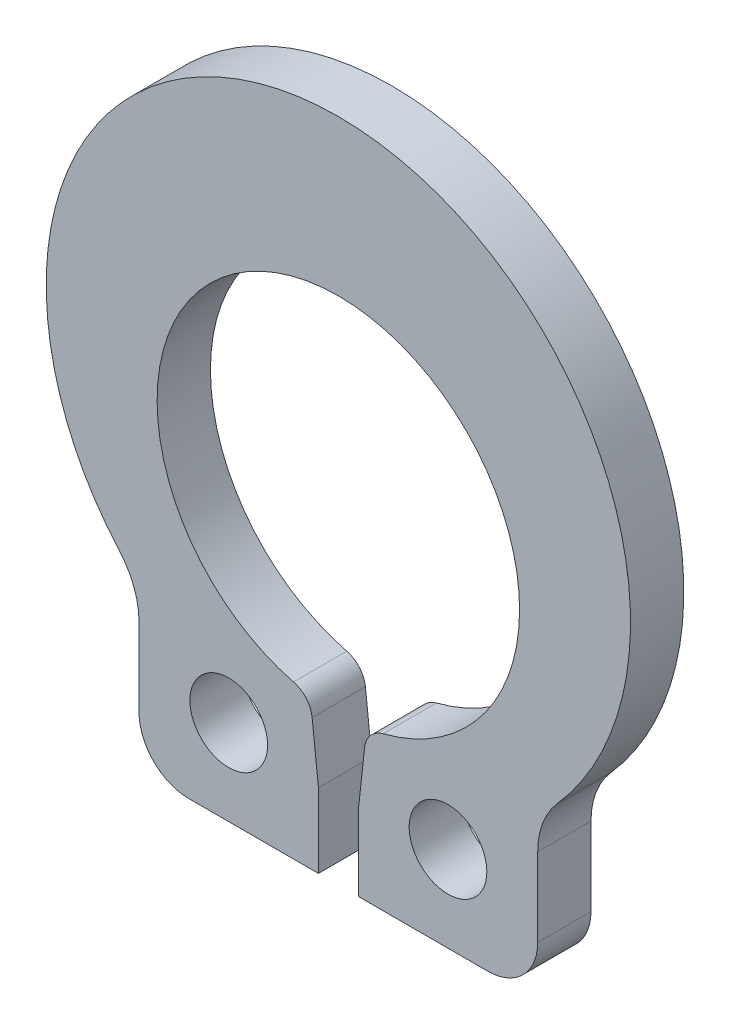
ISO-10303-21;
HEADER;
FILE_DESCRIPTION(('STEP AP214'),'2;1');
FILE_NAME('part.step','',(''),(''),'','','');
FILE_SCHEMA(('AUTOMOTIVE_DESIGN { 1 0 10303 214 1 1 1 1 }'));
ENDSEC;
DATA;
#1=APPLICATION_CONTEXT('core data for automotive mechanical design processes');
#2=APPLICATION_PROTOCOL_DEFINITION('international standard','automotive_design',2000,#1);
#3=PRODUCT_CONTEXT('',#1,'mechanical');
#4=PRODUCT('Part','Part','',(#3));
#5=PRODUCT_RELATED_PRODUCT_CATEGORY('part','',(#4));
#6=PRODUCT_DEFINITION_FORMATION('','',#4);
#7=PRODUCT_DEFINITION_CONTEXT('part definition',#1,'design');
#8=PRODUCT_DEFINITION('design','',#6,#7);
#9=PRODUCT_DEFINITION_SHAPE('','',#8);
#10=(LENGTH_UNIT() NAMED_UNIT(*) SI_UNIT(.MILLI.,.METRE.));
#11=(NAMED_UNIT(*) PLANE_ANGLE_UNIT() SI_UNIT($,.RADIAN.));
#12=(NAMED_UNIT(*) SI_UNIT($,.STERADIAN.) SOLID_ANGLE_UNIT());
#13=UNCERTAINTY_MEASURE_WITH_UNIT(LENGTH_MEASURE(1.E-05),#10,'distance_accuracy_value','');
#14=(GEOMETRIC_REPRESENTATION_CONTEXT(3) GLOBAL_UNCERTAINTY_ASSIGNED_CONTEXT((#13)) GLOBAL_UNIT_ASSIGNED_CONTEXT((#10,
#11,#12)) REPRESENTATION_CONTEXT('',''));
#15=CARTESIAN_POINT('',(0.,0.,0.));
#16=DIRECTION('',(0.,0.,1.));
#17=DIRECTION('',(1.,0.,0.));
#18=AXIS2_PLACEMENT_3D('',#15,#16,#17);
#19=CARTESIAN_POINT('',(0.,0.74041,0.4445));
#20=DIRECTION('',(0.,0.,1.));
#21=DIRECTION('',(1.,0.,0.));
#22=AXIS2_PLACEMENT_3D('',#19,#20,#21);
#23=PLANE('',#22);
#24=CARTESIAN_POINT('',(0.,0.,0.4445));
#25=DIRECTION('',(0.,0.,-1.));
#26=DIRECTION('',(1.,0.,0.));
#27=AXIS2_PLACEMENT_3D('',#24,#25,#26);
#28=CIRCLE('',#27,3.0226);
#29=CARTESIAN_POINT('',(-0.748225218508334,-2.92852689630609,0.4445));
#30=VERTEX_POINT('',#29);
#31=CARTESIAN_POINT('',(0.748225218508334,-2.92852689630609,0.4445));
#32=VERTEX_POINT('',#31);
#33=EDGE_CURVE('E173',#30,#32,#28,.T.);
#34=ORIENTED_EDGE('',*,*,#33,.T.);
#35=CARTESIAN_POINT('',(0.851263376225185,-3.33181458129109,0.4445));
#36=DIRECTION('',(0.,0.,1.));
#37=DIRECTION('',(1.,0.,0.));
#38=AXIS2_PLACEMENT_3D('',#35,#36,#37);
#39=CIRCLE('',#38,0.4162425);
#40=CARTESIAN_POINT('',(0.437494880862682,-3.28649956113553,0.4445));
#41=VERTEX_POINT('',#40);
#42=EDGE_CURVE('E165',#32,#41,#39,.T.);
#43=ORIENTED_EDGE('',*,*,#42,.T.);
#44=DIRECTION('',(0.108866874851965,0.99405633822232,0.));
#45=VECTOR('',#44,1.);
#46=CARTESIAN_POINT('',(0.332486,-4.24532880770958,0.4445));
#47=LINE('',#46,#45);
#48=CARTESIAN_POINT('',(0.332486,-4.24532880770958,0.4445));
#49=VERTEX_POINT('',#48);
#50=EDGE_CURVE('E152',#49,#41,#47,.T.);
#51=ORIENTED_EDGE('',*,*,#50,.F.);
#52=DIRECTION('',(0.,-1.,0.));
#53=VECTOR('',#52,1.);
#54=CARTESIAN_POINT('',(0.332486,-5.4864,0.4445));
#55=LINE('',#54,#53);
#56=CARTESIAN_POINT('',(0.332486,-5.4864,0.4445));
#57=VERTEX_POINT('',#56);
#58=EDGE_CURVE('E163',#49,#57,#55,.T.);
#59=ORIENTED_EDGE('',*,*,#58,.T.);
#60=DIRECTION('',(1.,0.,0.));
#61=VECTOR('',#60,1.);
#62=CARTESIAN_POINT('',(0.332486,-5.4864,0.4445));
#63=LINE('',#62,#61);
#64=CARTESIAN_POINT('',(2.492375,-5.4864,0.4445));
#65=VERTEX_POINT('',#64);
#66=EDGE_CURVE('E172',#57,#65,#63,.T.);
#67=ORIENTED_EDGE('',*,*,#66,.T.);
#68=CARTESIAN_POINT('',(2.492375,-4.653915,0.4445));
#69=DIRECTION('',(0.,0.,1.));
#70=DIRECTION('',(1.,0.,0.));
#71=AXIS2_PLACEMENT_3D('',#68,#69,#70);
#72=CIRCLE('',#71,0.832484999999999);
#73=CARTESIAN_POINT('',(3.32486,-4.653915,0.4445));
#74=VERTEX_POINT('',#73);
#75=EDGE_CURVE('E175',#65,#74,#72,.T.);
#76=ORIENTED_EDGE('',*,*,#75,.T.);
#77=DIRECTION('',(0.,1.,0.));
#78=VECTOR('',#77,1.);
#79=CARTESIAN_POINT('',(3.32486,-4.653915,0.4445));
#80=LINE('',#79,#78);
#81=CARTESIAN_POINT('',(3.32486,-3.34642651795616,0.4445));
#82=VERTEX_POINT('',#81);
#83=EDGE_CURVE('E182',#74,#82,#80,.T.);
#84=ORIENTED_EDGE('',*,*,#83,.T.);
#85=CARTESIAN_POINT('',(4.62026,-3.34642651795616,0.4445));
#86=DIRECTION('',(0.,0.,-1.));
#87=DIRECTION('',(1.,0.,0.));
#88=AXIS2_PLACEMENT_3D('',#85,#86,#87);
#89=CIRCLE('',#88,1.2954);
#90=CARTESIAN_POINT('',(3.64997686226065,-2.48816560621737,0.4445));
#91=VERTEX_POINT('',#90);
#92=EDGE_CURVE('E184',#82,#91,#89,.T.);
#93=ORIENTED_EDGE('',*,*,#92,.T.);
#94=CARTESIAN_POINT('',(0.,0.74041,0.4445));
#95=DIRECTION('',(0.,0.,1.));
#96=DIRECTION('',(1.,0.,0.));
#97=AXIS2_PLACEMENT_3D('',#94,#95,#96);
#98=CIRCLE('',#97,4.87299);
#99=CARTESIAN_POINT('',(-3.64997686226066,-2.48816560621737,0.4445));
#100=VERTEX_POINT('',#99);
#101=EDGE_CURVE('E215',#91,#100,#98,.T.);
#102=ORIENTED_EDGE('',*,*,#101,.T.);
#103=CARTESIAN_POINT('',(-4.62026,-3.34642651795616,0.4445));
#104=DIRECTION('',(0.,0.,-1.));
#105=DIRECTION('',(1.,0.,0.));
#106=AXIS2_PLACEMENT_3D('',#103,#104,#105);
#107=CIRCLE('',#106,1.2954);
#108=CARTESIAN_POINT('',(-3.32486,-3.34642651795616,0.4445));
#109=VERTEX_POINT('',#108);
#110=EDGE_CURVE('E336',#100,#109,#107,.T.);
#111=ORIENTED_EDGE('',*,*,#110,.T.);
#112=DIRECTION('',(0.,-1.,0.));
#113=VECTOR('',#112,1.);
#114=CARTESIAN_POINT('',(-3.32486,-4.653915,0.4445));
#115=LINE('',#114,#113);
#116=CARTESIAN_POINT('',(-3.32486,-4.653915,0.4445));
#117=VERTEX_POINT('',#116);
#118=EDGE_CURVE('E339',#109,#117,#115,.T.);
#119=ORIENTED_EDGE('',*,*,#118,.T.);
#120=CARTESIAN_POINT('',(-2.492375,-4.653915,0.4445));
#121=DIRECTION('',(0.,0.,1.));
#122=DIRECTION('',(1.,0.,0.));
#123=AXIS2_PLACEMENT_3D('',#120,#121,#122);
#124=CIRCLE('',#123,0.832484999999999);
#125=CARTESIAN_POINT('',(-2.492375,-5.4864,0.4445));
#126=VERTEX_POINT('',#125);
#127=EDGE_CURVE('E348',#117,#126,#124,.T.);
#128=ORIENTED_EDGE('',*,*,#127,.T.);
#129=DIRECTION('',(1.,0.,0.));
#130=VECTOR('',#129,1.);
#131=CARTESIAN_POINT('',(-0.332486,-5.4864,0.4445));
#132=LINE('',#131,#130);
#133=CARTESIAN_POINT('',(-0.332486,-5.4864,0.4445));
#134=VERTEX_POINT('',#133);
#135=EDGE_CURVE('E350',#126,#134,#132,.T.);
#136=ORIENTED_EDGE('',*,*,#135,.T.);
#137=DIRECTION('',(0.,1.,0.));
#138=VECTOR('',#137,1.);
#139=CARTESIAN_POINT('',(-0.332486,-5.4864,0.4445));
#140=LINE('',#139,#138);
#141=CARTESIAN_POINT('',(-0.332486,-4.24532880770958,0.4445));
#142=VERTEX_POINT('',#141);
#143=EDGE_CURVE('E177',#134,#142,#140,.T.);
#144=ORIENTED_EDGE('',*,*,#143,.T.);
#145=DIRECTION('',(0.108866874851965,-0.99405633822232,0.));
#146=VECTOR('',#145,1.);
#147=CARTESIAN_POINT('',(-0.332486,-4.24532880770958,0.4445));
#148=LINE('',#147,#146);
#149=CARTESIAN_POINT('',(-0.437494880862682,-3.28649956113553,0.4445));
#150=VERTEX_POINT('',#149);
#151=EDGE_CURVE('E166',#150,#142,#148,.T.);
#152=ORIENTED_EDGE('',*,*,#151,.F.);
#153=CARTESIAN_POINT('',(-0.851263376225185,-3.33181458129109,0.4445));
#154=DIRECTION('',(0.,0.,1.));
#155=DIRECTION('',(1.,0.,0.));
#156=AXIS2_PLACEMENT_3D('',#153,#154,#155);
#157=CIRCLE('',#156,0.4162425);
#158=EDGE_CURVE('E249',#150,#30,#157,.T.);
#159=ORIENTED_EDGE('',*,*,#158,.T.);
#160=EDGE_LOOP('',(#34,#43,#51,#59,#67,#76,#84,#93,#102,#111,#119,#128,#136,#144,#152,#159));
#161=FACE_BOUND('',#160,.T.);
#162=CARTESIAN_POINT('',(-1.828673,-4.0579995333806,0.4445));
#163=DIRECTION('',(0.,0.,1.));
#164=DIRECTION('',(1.,0.,0.));
#165=AXIS2_PLACEMENT_3D('',#162,#163,#164);
#166=CIRCLE('',#165,0.6477);
#167=CARTESIAN_POINT('',(-1.180973,-4.0579995333806,0.4445));
#168=VERTEX_POINT('',#167);
#169=EDGE_CURVE('E191',#168,#168,#166,.T.);
#170=ORIENTED_EDGE('',*,*,#169,.F.);
#171=EDGE_LOOP('',(#170));
#172=FACE_BOUND('',#171,.T.);
#173=CARTESIAN_POINT('',(1.828673,-4.0579995333806,0.4445));
#174=DIRECTION('',(0.,0.,1.));
#175=DIRECTION('',(1.,0.,0.));
#176=AXIS2_PLACEMENT_3D('',#173,#174,#175);
#177=CIRCLE('',#176,0.647700000000001);
#178=CARTESIAN_POINT('',(2.476373,-4.0579995333806,0.4445));
#179=VERTEX_POINT('',#178);
#180=EDGE_CURVE('E363',#179,#179,#177,.T.);
#181=ORIENTED_EDGE('',*,*,#180,.F.);
#182=EDGE_LOOP('',(#181));
#183=FACE_BOUND('',#182,.T.);
#184=ADVANCED_FACE('F38',(#161,#172,#183),#23,.T.);
#185=CARTESIAN_POINT('',(0.,0.74041,-0.4445));
#186=DIRECTION('',(0.,0.,1.));
#187=DIRECTION('',(1.,0.,0.));
#188=AXIS2_PLACEMENT_3D('',#185,#186,#187);
#189=PLANE('',#188);
#190=DIRECTION('',(0.108866874851965,0.99405633822232,0.));
#191=VECTOR('',#190,1.);
#192=CARTESIAN_POINT('',(0.332486,-4.24532880770958,-0.4445));
#193=LINE('',#192,#191);
#194=CARTESIAN_POINT('',(0.332486,-4.24532880770958,-0.4445));
#195=VERTEX_POINT('',#194);
#196=CARTESIAN_POINT('',(0.437494880862682,-3.28649956113553,-0.4445));
#197=VERTEX_POINT('',#196);
#198=EDGE_CURVE('E153',#195,#197,#193,.T.);
#199=ORIENTED_EDGE('',*,*,#198,.T.);
#200=CARTESIAN_POINT('',(0.851263376225185,-3.33181458129109,-0.4445));
#201=DIRECTION('',(0.,0.,1.));
#202=DIRECTION('',(1.,0.,0.));
#203=AXIS2_PLACEMENT_3D('',#200,#201,#202);
#204=CIRCLE('',#203,0.4162425);
#205=CARTESIAN_POINT('',(0.748225218508334,-2.92852689630609,-0.4445));
#206=VERTEX_POINT('',#205);
#207=EDGE_CURVE('E46',#197,#206,#204,.F.);
#208=ORIENTED_EDGE('',*,*,#207,.T.);
#209=CARTESIAN_POINT('',(0.,0.,-0.4445));
#210=DIRECTION('',(0.,0.,-1.));
#211=DIRECTION('',(1.,0.,0.));
#212=AXIS2_PLACEMENT_3D('',#209,#210,#211);
#213=CIRCLE('',#212,3.0226);
#214=CARTESIAN_POINT('',(-0.748225218508334,-2.92852689630609,-0.4445));
#215=VERTEX_POINT('',#214);
#216=EDGE_CURVE('E202',#215,#206,#213,.T.);
#217=ORIENTED_EDGE('',*,*,#216,.F.);
#218=CARTESIAN_POINT('',(-0.851263376225185,-3.33181458129109,-0.4445));
#219=DIRECTION('',(0.,0.,1.));
#220=DIRECTION('',(1.,0.,0.));
#221=AXIS2_PLACEMENT_3D('',#218,#219,#220);
#222=CIRCLE('',#221,0.4162425);
#223=CARTESIAN_POINT('',(-0.437494880862682,-3.28649956113553,-0.4445));
#224=VERTEX_POINT('',#223);
#225=EDGE_CURVE('E53',#215,#224,#222,.F.);
#226=ORIENTED_EDGE('',*,*,#225,.T.);
#227=DIRECTION('',(0.108866874851965,-0.99405633822232,0.));
#228=VECTOR('',#227,1.);
#229=CARTESIAN_POINT('',(-0.332486,-4.24532880770958,-0.4445));
#230=LINE('',#229,#228);
#231=CARTESIAN_POINT('',(-0.332486,-4.24532880770958,-0.4445));
#232=VERTEX_POINT('',#231);
#233=EDGE_CURVE('E158',#224,#232,#230,.T.);
#234=ORIENTED_EDGE('',*,*,#233,.T.);
#235=DIRECTION('',(0.,1.,0.));
#236=VECTOR('',#235,1.);
#237=CARTESIAN_POINT('',(-0.332486,-5.4864,-0.4445));
#238=LINE('',#237,#236);
#239=CARTESIAN_POINT('',(-0.332486,-5.4864,-0.4445));
#240=VERTEX_POINT('',#239);
#241=EDGE_CURVE('E199',#240,#232,#238,.T.);
#242=ORIENTED_EDGE('',*,*,#241,.F.);
#243=DIRECTION('',(1.,0.,0.));
#244=VECTOR('',#243,1.);
#245=CARTESIAN_POINT('',(-0.332486,-5.4864,-0.4445));
#246=LINE('',#245,#244);
#247=CARTESIAN_POINT('',(-2.492375,-5.4864,-0.4445));
#248=VERTEX_POINT('',#247);
#249=EDGE_CURVE('E197',#248,#240,#246,.T.);
#250=ORIENTED_EDGE('',*,*,#249,.F.);
#251=CARTESIAN_POINT('',(-2.492375,-4.653915,-0.4445));
#252=DIRECTION('',(0.,0.,1.));
#253=DIRECTION('',(1.,0.,0.));
#254=AXIS2_PLACEMENT_3D('',#251,#252,#253);
#255=CIRCLE('',#254,0.832484999999999);
#256=CARTESIAN_POINT('',(-3.32486,-4.653915,-0.4445));
#257=VERTEX_POINT('',#256);
#258=EDGE_CURVE('E195',#257,#248,#255,.T.);
#259=ORIENTED_EDGE('',*,*,#258,.F.);
#260=DIRECTION('',(0.,-1.,0.));
#261=VECTOR('',#260,1.);
#262=CARTESIAN_POINT('',(-3.32486,-4.653915,-0.4445));
#263=LINE('',#262,#261);
#264=CARTESIAN_POINT('',(-3.32486,-3.34642651795616,-0.4445));
#265=VERTEX_POINT('',#264);
#266=EDGE_CURVE('E193',#265,#257,#263,.T.);
#267=ORIENTED_EDGE('',*,*,#266,.F.);
#268=CARTESIAN_POINT('',(-4.62026,-3.34642651795616,-0.4445));
#269=DIRECTION('',(0.,0.,-1.));
#270=DIRECTION('',(1.,0.,0.));
#271=AXIS2_PLACEMENT_3D('',#268,#269,#270);
#272=CIRCLE('',#271,1.2954);
#273=CARTESIAN_POINT('',(-3.64997686226066,-2.48816560621737,-0.4445));
#274=VERTEX_POINT('',#273);
#275=EDGE_CURVE('E190',#274,#265,#272,.T.);
#276=ORIENTED_EDGE('',*,*,#275,.F.);
#277=CARTESIAN_POINT('',(0.,0.74041,-0.4445));
#278=DIRECTION('',(0.,0.,1.));
#279=DIRECTION('',(1.,0.,0.));
#280=AXIS2_PLACEMENT_3D('',#277,#278,#279);
#281=CIRCLE('',#280,4.87299);
#282=CARTESIAN_POINT('',(3.64997686226065,-2.48816560621737,-0.4445));
#283=VERTEX_POINT('',#282);
#284=EDGE_CURVE('E187',#283,#274,#281,.T.);
#285=ORIENTED_EDGE('',*,*,#284,.F.);
#286=CARTESIAN_POINT('',(4.62026,-3.34642651795616,-0.4445));
#287=DIRECTION('',(0.,0.,-1.));
#288=DIRECTION('',(1.,0.,0.));
#289=AXIS2_PLACEMENT_3D('',#286,#287,#288);
#290=CIRCLE('',#289,1.2954);
#291=CARTESIAN_POINT('',(3.32486,-3.34642651795616,-0.4445));
#292=VERTEX_POINT('',#291);
#293=EDGE_CURVE('E213',#292,#283,#290,.T.);
#294=ORIENTED_EDGE('',*,*,#293,.F.);
#295=DIRECTION('',(0.,1.,0.));
#296=VECTOR('',#295,1.);
#297=CARTESIAN_POINT('',(3.32486,-4.653915,-0.4445));
#298=LINE('',#297,#296);
#299=CARTESIAN_POINT('',(3.32486,-4.653915,-0.4445));
#300=VERTEX_POINT('',#299);
#301=EDGE_CURVE('E211',#300,#292,#298,.T.);
#302=ORIENTED_EDGE('',*,*,#301,.F.);
#303=CARTESIAN_POINT('',(2.492375,-4.653915,-0.4445));
#304=DIRECTION('',(0.,0.,1.));
#305=DIRECTION('',(1.,0.,0.));
#306=AXIS2_PLACEMENT_3D('',#303,#304,#305);
#307=CIRCLE('',#306,0.832484999999999);
#308=CARTESIAN_POINT('',(2.492375,-5.4864,-0.4445));
#309=VERTEX_POINT('',#308);
#310=EDGE_CURVE('E209',#309,#300,#307,.T.);
#311=ORIENTED_EDGE('',*,*,#310,.F.);
#312=DIRECTION('',(1.,0.,0.));
#313=VECTOR('',#312,1.);
#314=CARTESIAN_POINT('',(0.332486,-5.4864,-0.4445));
#315=LINE('',#314,#313);
#316=CARTESIAN_POINT('',(0.332486,-5.4864,-0.4445));
#317=VERTEX_POINT('',#316);
#318=EDGE_CURVE('E207',#317,#309,#315,.T.);
#319=ORIENTED_EDGE('',*,*,#318,.F.);
#320=DIRECTION('',(0.,-1.,0.));
#321=VECTOR('',#320,1.);
#322=CARTESIAN_POINT('',(0.332486,-5.4864,-0.4445));
#323=LINE('',#322,#321);
#324=EDGE_CURVE('E205',#195,#317,#323,.T.);
#325=ORIENTED_EDGE('',*,*,#324,.F.);
#326=EDGE_LOOP('',(#199,#208,#217,#226,#234,#242,#250,#259,#267,#276,#285,#294,#302,#311,#319,#325));
#327=FACE_BOUND('',#326,.T.);
#328=CARTESIAN_POINT('',(-1.828673,-4.0579995333806,-0.4445));
#329=DIRECTION('',(0.,0.,1.));
#330=DIRECTION('',(1.,0.,0.));
#331=AXIS2_PLACEMENT_3D('',#328,#329,#330);
#332=CIRCLE('',#331,0.6477);
#333=CARTESIAN_POINT('',(-1.180973,-4.0579995333806,-0.4445));
#334=VERTEX_POINT('',#333);
#335=EDGE_CURVE('E344',#334,#334,#332,.T.);
#336=ORIENTED_EDGE('',*,*,#335,.T.);
#337=EDGE_LOOP('',(#336));
#338=FACE_BOUND('',#337,.T.);
#339=CARTESIAN_POINT('',(1.828673,-4.0579995333806,-0.4445));
#340=DIRECTION('',(0.,0.,1.));
#341=DIRECTION('',(1.,0.,0.));
#342=AXIS2_PLACEMENT_3D('',#339,#340,#341);
#343=CIRCLE('',#342,0.647700000000001);
#344=CARTESIAN_POINT('',(2.476373,-4.0579995333806,-0.4445));
#345=VERTEX_POINT('',#344);
#346=EDGE_CURVE('E360',#345,#345,#343,.T.);
#347=ORIENTED_EDGE('',*,*,#346,.T.);
#348=EDGE_LOOP('',(#347));
#349=FACE_BOUND('',#348,.T.);
#350=ADVANCED_FACE('F254',(#327,#338,#349),#189,.F.);
#351=CARTESIAN_POINT('',(0.,0.74041,0.4445));
#352=DIRECTION('',(0.,0.,-1.));
#353=DIRECTION('',(-1.,0.,0.));
#354=AXIS2_PLACEMENT_3D('',#351,#352,#353);
#355=CYLINDRICAL_SURFACE('',#354,4.87299);
#356=ORIENTED_EDGE('',*,*,#284,.T.);
#357=DIRECTION('',(0.,0.,-1.));
#358=VECTOR('',#357,1.);
#359=CARTESIAN_POINT('',(-3.64997686226066,-2.48816560621737,0.4445));
#360=LINE('',#359,#358);
#361=EDGE_CURVE('E240',#100,#274,#360,.T.);
#362=ORIENTED_EDGE('',*,*,#361,.F.);
#363=ORIENTED_EDGE('',*,*,#101,.F.);
#364=DIRECTION('',(0.,0.,-1.));
#365=VECTOR('',#364,1.);
#366=CARTESIAN_POINT('',(3.64997686226065,-2.48816560621737,0.4445));
#367=LINE('',#366,#365);
#368=EDGE_CURVE('E186',#91,#283,#367,.T.);
#369=ORIENTED_EDGE('',*,*,#368,.T.);
#370=EDGE_LOOP('',(#356,#362,#363,#369));
#371=FACE_BOUND('',#370,.T.);
#372=ADVANCED_FACE('F278',(#371),#355,.T.);
#373=CARTESIAN_POINT('',(-4.62026,-3.34642651795616,0.4445));
#374=DIRECTION('',(0.,0.,-1.));
#375=DIRECTION('',(-1.,0.,0.));
#376=AXIS2_PLACEMENT_3D('',#373,#374,#375);
#377=CYLINDRICAL_SURFACE('',#376,1.2954);
#378=ORIENTED_EDGE('',*,*,#275,.T.);
#379=DIRECTION('',(0.,0.,-1.));
#380=VECTOR('',#379,1.);
#381=CARTESIAN_POINT('',(-3.32486,-3.34642651795616,0.4445));
#382=LINE('',#381,#380);
#383=EDGE_CURVE('E237',#109,#265,#382,.T.);
#384=ORIENTED_EDGE('',*,*,#383,.F.);
#385=ORIENTED_EDGE('',*,*,#110,.F.);
#386=ORIENTED_EDGE('',*,*,#361,.T.);
#387=EDGE_LOOP('',(#378,#384,#385,#386));
#388=FACE_BOUND('',#387,.T.);
#389=ADVANCED_FACE('F319',(#388),#377,.F.);
#390=CARTESIAN_POINT('',(-3.32486,-4.653915,0.4445));
#391=DIRECTION('',(1.,0.,0.));
#392=DIRECTION('',(0.,1.,0.));
#393=AXIS2_PLACEMENT_3D('',#390,#391,#392);
#394=PLANE('',#393);
#395=ORIENTED_EDGE('',*,*,#266,.T.);
#396=DIRECTION('',(0.,0.,-1.));
#397=VECTOR('',#396,1.);
#398=CARTESIAN_POINT('',(-3.32486,-4.653915,0.4445));
#399=LINE('',#398,#397);
#400=EDGE_CURVE('E234',#117,#257,#399,.T.);
#401=ORIENTED_EDGE('',*,*,#400,.F.);
#402=ORIENTED_EDGE('',*,*,#118,.F.);
#403=ORIENTED_EDGE('',*,*,#383,.T.);
#404=EDGE_LOOP('',(#395,#401,#402,#403));
#405=FACE_BOUND('',#404,.T.);
#406=ADVANCED_FACE('F315',(#405),#394,.F.);
#407=CARTESIAN_POINT('',(-2.492375,-4.653915,0.4445));
#408=DIRECTION('',(0.,0.,-1.));
#409=DIRECTION('',(-1.,0.,0.));
#410=AXIS2_PLACEMENT_3D('',#407,#408,#409);
#411=CYLINDRICAL_SURFACE('',#410,0.832484999999999);
#412=ORIENTED_EDGE('',*,*,#258,.T.);
#413=DIRECTION('',(0.,0.,-1.));
#414=VECTOR('',#413,1.);
#415=CARTESIAN_POINT('',(-2.492375,-5.4864,0.4445));
#416=LINE('',#415,#414);
#417=EDGE_CURVE('E231',#126,#248,#416,.T.);
#418=ORIENTED_EDGE('',*,*,#417,.F.);
#419=ORIENTED_EDGE('',*,*,#127,.F.);
#420=ORIENTED_EDGE('',*,*,#400,.T.);
#421=EDGE_LOOP('',(#412,#418,#419,#420));
#422=FACE_BOUND('',#421,.T.);
#423=ADVANCED_FACE('F311',(#422),#411,.T.);
#424=CARTESIAN_POINT('',(-0.332486,-5.4864,0.4445));
#425=DIRECTION('',(0.,1.,0.));
#426=DIRECTION('',(0.,0.,1.));
#427=AXIS2_PLACEMENT_3D('',#424,#425,#426);
#428=PLANE('',#427);
#429=ORIENTED_EDGE('',*,*,#249,.T.);
#430=DIRECTION('',(0.,0.,-1.));
#431=VECTOR('',#430,1.);
#432=CARTESIAN_POINT('',(-0.332486,-5.4864,0.4445));
#433=LINE('',#432,#431);
#434=EDGE_CURVE('E228',#134,#240,#433,.T.);
#435=ORIENTED_EDGE('',*,*,#434,.F.);
#436=ORIENTED_EDGE('',*,*,#135,.F.);
#437=ORIENTED_EDGE('',*,*,#417,.T.);
#438=EDGE_LOOP('',(#429,#435,#436,#437));
#439=FACE_BOUND('',#438,.T.);
#440=ADVANCED_FACE('F307',(#439),#428,.F.);
#441=CARTESIAN_POINT('',(-0.332486,-5.4864,0.4445));
#442=DIRECTION('',(-1.,0.,0.));
#443=DIRECTION('',(0.,-1.,0.));
#444=AXIS2_PLACEMENT_3D('',#441,#442,#443);
#445=PLANE('',#444);
#446=ORIENTED_EDGE('',*,*,#241,.T.);
#447=DIRECTION('',(0.,0.,1.));
#448=VECTOR('',#447,1.);
#449=CARTESIAN_POINT('',(-0.332486,-4.24532880770958,-0.4445));
#450=LINE('',#449,#448);
#451=EDGE_CURVE('E157',#232,#142,#450,.T.);
#452=ORIENTED_EDGE('',*,*,#451,.T.);
#453=ORIENTED_EDGE('',*,*,#143,.F.);
#454=ORIENTED_EDGE('',*,*,#434,.T.);
#455=EDGE_LOOP('',(#446,#452,#453,#454));
#456=FACE_BOUND('',#455,.T.);
#457=ADVANCED_FACE('F304',(#456),#445,.F.);
#458=CARTESIAN_POINT('',(0.,0.,0.4445));
#459=DIRECTION('',(0.,0.,-1.));
#460=DIRECTION('',(-1.,0.,0.));
#461=AXIS2_PLACEMENT_3D('',#458,#459,#460);
#462=CYLINDRICAL_SURFACE('',#461,3.0226);
#463=ORIENTED_EDGE('',*,*,#216,.T.);
#464=DIRECTION('',(0.,0.,-1.));
#465=VECTOR('',#464,1.);
#466=CARTESIAN_POINT('',(0.748225218508334,-2.92852689630609,0.4445));
#467=LINE('',#466,#465);
#468=EDGE_CURVE('E246',#206,#32,#467,.F.);
#469=ORIENTED_EDGE('',*,*,#468,.T.);
#470=ORIENTED_EDGE('',*,*,#33,.F.);
#471=DIRECTION('',(0.,0.,-1.));
#472=VECTOR('',#471,1.);
#473=CARTESIAN_POINT('',(-0.748225218508334,-2.92852689630609,0.4445));
#474=LINE('',#473,#472);
#475=EDGE_CURVE('E243',#30,#215,#474,.T.);
#476=ORIENTED_EDGE('',*,*,#475,.T.);
#477=EDGE_LOOP('',(#463,#469,#470,#476));
#478=FACE_BOUND('',#477,.T.);
#479=ADVANCED_FACE('F259',(#478),#462,.F.);
#480=CARTESIAN_POINT('',(0.332486,-5.4864,0.4445));
#481=DIRECTION('',(1.,0.,0.));
#482=DIRECTION('',(0.,1.,0.));
#483=AXIS2_PLACEMENT_3D('',#480,#481,#482);
#484=PLANE('',#483);
#485=ORIENTED_EDGE('',*,*,#58,.F.);
#486=DIRECTION('',(0.,0.,1.));
#487=VECTOR('',#486,1.);
#488=CARTESIAN_POINT('',(0.332486,-4.24532880770958,-0.4445));
#489=LINE('',#488,#487);
#490=EDGE_CURVE('E149',#195,#49,#489,.T.);
#491=ORIENTED_EDGE('',*,*,#490,.F.);
#492=ORIENTED_EDGE('',*,*,#324,.T.);
#493=DIRECTION('',(0.,0.,-1.));
#494=VECTOR('',#493,1.);
#495=CARTESIAN_POINT('',(0.332486,-5.4864,0.4445));
#496=LINE('',#495,#494);
#497=EDGE_CURVE('E170',#57,#317,#496,.T.);
#498=ORIENTED_EDGE('',*,*,#497,.F.);
#499=EDGE_LOOP('',(#485,#491,#492,#498));
#500=FACE_BOUND('',#499,.T.);
#501=ADVANCED_FACE('F168',(#500),#484,.F.);
#502=CARTESIAN_POINT('',(0.332486,-5.4864,0.4445));
#503=DIRECTION('',(0.,1.,0.));
#504=DIRECTION('',(0.,0.,1.));
#505=AXIS2_PLACEMENT_3D('',#502,#503,#504);
#506=PLANE('',#505);
#507=ORIENTED_EDGE('',*,*,#318,.T.);
#508=DIRECTION('',(0.,0.,-1.));
#509=VECTOR('',#508,1.);
#510=CARTESIAN_POINT('',(2.492375,-5.4864,0.4445));
#511=LINE('',#510,#509);
#512=EDGE_CURVE('E224',#65,#309,#511,.T.);
#513=ORIENTED_EDGE('',*,*,#512,.F.);
#514=ORIENTED_EDGE('',*,*,#66,.F.);
#515=ORIENTED_EDGE('',*,*,#497,.T.);
#516=EDGE_LOOP('',(#507,#513,#514,#515));
#517=FACE_BOUND('',#516,.T.);
#518=ADVANCED_FACE('F295',(#517),#506,.F.);
#519=CARTESIAN_POINT('',(2.492375,-4.653915,0.4445));
#520=DIRECTION('',(0.,0.,-1.));
#521=DIRECTION('',(-1.,0.,0.));
#522=AXIS2_PLACEMENT_3D('',#519,#520,#521);
#523=CYLINDRICAL_SURFACE('',#522,0.832484999999999);
#524=ORIENTED_EDGE('',*,*,#310,.T.);
#525=DIRECTION('',(0.,0.,-1.));
#526=VECTOR('',#525,1.);
#527=CARTESIAN_POINT('',(3.32486,-4.653915,0.4445));
#528=LINE('',#527,#526);
#529=EDGE_CURVE('E221',#74,#300,#528,.T.);
#530=ORIENTED_EDGE('',*,*,#529,.F.);
#531=ORIENTED_EDGE('',*,*,#75,.F.);
#532=ORIENTED_EDGE('',*,*,#512,.T.);
#533=EDGE_LOOP('',(#524,#530,#531,#532));
#534=FACE_BOUND('',#533,.T.);
#535=ADVANCED_FACE('F291',(#534),#523,.T.);
#536=CARTESIAN_POINT('',(3.32486,-4.653915,0.4445));
#537=DIRECTION('',(-1.,0.,0.));
#538=DIRECTION('',(0.,-1.,0.));
#539=AXIS2_PLACEMENT_3D('',#536,#537,#538);
#540=PLANE('',#539);
#541=ORIENTED_EDGE('',*,*,#301,.T.);
#542=DIRECTION('',(0.,0.,-1.));
#543=VECTOR('',#542,1.);
#544=CARTESIAN_POINT('',(3.32486,-3.34642651795616,0.4445));
#545=LINE('',#544,#543);
#546=EDGE_CURVE('E218',#82,#292,#545,.T.);
#547=ORIENTED_EDGE('',*,*,#546,.F.);
#548=ORIENTED_EDGE('',*,*,#83,.F.);
#549=ORIENTED_EDGE('',*,*,#529,.T.);
#550=EDGE_LOOP('',(#541,#547,#548,#549));
#551=FACE_BOUND('',#550,.T.);
#552=ADVANCED_FACE('F287',(#551),#540,.F.);
#553=CARTESIAN_POINT('',(4.62026,-3.34642651795616,0.4445));
#554=DIRECTION('',(0.,0.,-1.));
#555=DIRECTION('',(-1.,0.,0.));
#556=AXIS2_PLACEMENT_3D('',#553,#554,#555);
#557=CYLINDRICAL_SURFACE('',#556,1.2954);
#558=ORIENTED_EDGE('',*,*,#293,.T.);
#559=ORIENTED_EDGE('',*,*,#368,.F.);
#560=ORIENTED_EDGE('',*,*,#92,.F.);
#561=ORIENTED_EDGE('',*,*,#546,.T.);
#562=EDGE_LOOP('',(#558,#559,#560,#561));
#563=FACE_BOUND('',#562,.T.);
#564=ADVANCED_FACE('F284',(#563),#557,.F.);
#565=CARTESIAN_POINT('',(-1.828673,-4.0579995333806,0.4445));
#566=DIRECTION('',(0.,0.,-1.));
#567=DIRECTION('',(-1.,0.,0.));
#568=AXIS2_PLACEMENT_3D('',#565,#566,#567);
#569=CYLINDRICAL_SURFACE('',#568,0.6477);
#570=ORIENTED_EDGE('',*,*,#169,.T.);
#571=EDGE_LOOP('',(#570));
#572=FACE_BOUND('',#571,.T.);
#573=ORIENTED_EDGE('',*,*,#335,.F.);
#574=EDGE_LOOP('',(#573));
#575=FACE_BOUND('',#574,.T.);
#576=ADVANCED_FACE('F281',(#572,#575),#569,.F.);
#577=CARTESIAN_POINT('',(1.828673,-4.0579995333806,0.4445));
#578=DIRECTION('',(0.,0.,-1.));
#579=DIRECTION('',(-1.,0.,0.));
#580=AXIS2_PLACEMENT_3D('',#577,#578,#579);
#581=CYLINDRICAL_SURFACE('',#580,0.647700000000001);
#582=ORIENTED_EDGE('',*,*,#180,.T.);
#583=EDGE_LOOP('',(#582));
#584=FACE_BOUND('',#583,.T.);
#585=ORIENTED_EDGE('',*,*,#346,.F.);
#586=EDGE_LOOP('',(#585));
#587=FACE_BOUND('',#586,.T.);
#588=ADVANCED_FACE('F377',(#584,#587),#581,.F.);
#589=CARTESIAN_POINT('',(0.332486,-4.24532880770958,-0.4445));
#590=DIRECTION('',(0.99405633822232,-0.108866874851965,0.));
#591=DIRECTION('',(0.108866874851965,0.99405633822232,0.));
#592=AXIS2_PLACEMENT_3D('',#589,#590,#591);
#593=PLANE('',#592);
#594=ORIENTED_EDGE('',*,*,#50,.T.);
#595=DIRECTION('',(0.,0.,-1.));
#596=VECTOR('',#595,1.);
#597=CARTESIAN_POINT('',(0.437494880862682,-3.28649956113553,-0.4445));
#598=LINE('',#597,#596);
#599=EDGE_CURVE('E61',#41,#197,#598,.T.);
#600=ORIENTED_EDGE('',*,*,#599,.T.);
#601=ORIENTED_EDGE('',*,*,#198,.F.);
#602=ORIENTED_EDGE('',*,*,#490,.T.);
#603=EDGE_LOOP('',(#594,#600,#601,#602));
#604=FACE_BOUND('',#603,.T.);
#605=ADVANCED_FACE('F151',(#604),#593,.F.);
#606=CARTESIAN_POINT('',(-0.332486,-4.24532880770958,-0.4445));
#607=DIRECTION('',(-0.99405633822232,-0.108866874851965,0.));
#608=DIRECTION('',(0.108866874851965,-0.99405633822232,0.));
#609=AXIS2_PLACEMENT_3D('',#606,#607,#608);
#610=PLANE('',#609);
#611=ORIENTED_EDGE('',*,*,#233,.F.);
#612=DIRECTION('',(0.,0.,-1.));
#613=VECTOR('',#612,1.);
#614=CARTESIAN_POINT('',(-0.437494880862682,-3.28649956113553,-0.4445));
#615=LINE('',#614,#613);
#616=EDGE_CURVE('E11',#224,#150,#615,.F.);
#617=ORIENTED_EDGE('',*,*,#616,.T.);
#618=ORIENTED_EDGE('',*,*,#151,.T.);
#619=ORIENTED_EDGE('',*,*,#451,.F.);
#620=EDGE_LOOP('',(#611,#617,#618,#619));
#621=FACE_BOUND('',#620,.T.);
#622=ADVANCED_FACE('F264',(#621),#610,.F.);
#623=CARTESIAN_POINT('',(0.851263376225185,-3.33181458129109,0.4445));
#624=DIRECTION('',(0.,0.,-1.));
#625=DIRECTION('',(-1.,0.,0.));
#626=AXIS2_PLACEMENT_3D('',#623,#624,#625);
#627=CYLINDRICAL_SURFACE('',#626,0.4162425);
#628=ORIENTED_EDGE('',*,*,#207,.F.);
#629=ORIENTED_EDGE('',*,*,#599,.F.);
#630=ORIENTED_EDGE('',*,*,#42,.F.);
#631=ORIENTED_EDGE('',*,*,#468,.F.);
#632=EDGE_LOOP('',(#628,#629,#630,#631));
#633=FACE_BOUND('',#632,.T.);
#634=ADVANCED_FACE('F262',(#633),#627,.T.);
#635=CARTESIAN_POINT('',(-0.851263376225185,-3.33181458129109,0.4445));
#636=DIRECTION('',(0.,0.,-1.));
#637=DIRECTION('',(-1.,0.,0.));
#638=AXIS2_PLACEMENT_3D('',#635,#636,#637);
#639=CYLINDRICAL_SURFACE('',#638,0.4162425);
#640=ORIENTED_EDGE('',*,*,#158,.F.);
#641=ORIENTED_EDGE('',*,*,#616,.F.);
#642=ORIENTED_EDGE('',*,*,#225,.F.);
#643=ORIENTED_EDGE('',*,*,#475,.F.);
#644=EDGE_LOOP('',(#640,#641,#642,#643));
#645=FACE_BOUND('',#644,.T.);
#646=ADVANCED_FACE('F40',(#645),#639,.T.);
#647=CLOSED_SHELL('',(#184,#350,#372,#389,#406,#423,#440,#457,#479,#501,#518,#535,#552,#564,
#576,#588,#605,#622,#634,#646));
#648=MANIFOLD_SOLID_BREP('B2',#647);
#649=ADVANCED_BREP_SHAPE_REPRESENTATION('',(#18,#648),#14);
#650=SHAPE_DEFINITION_REPRESENTATION(#9,#649);
ENDSEC;
END-ISO-10303-21;
